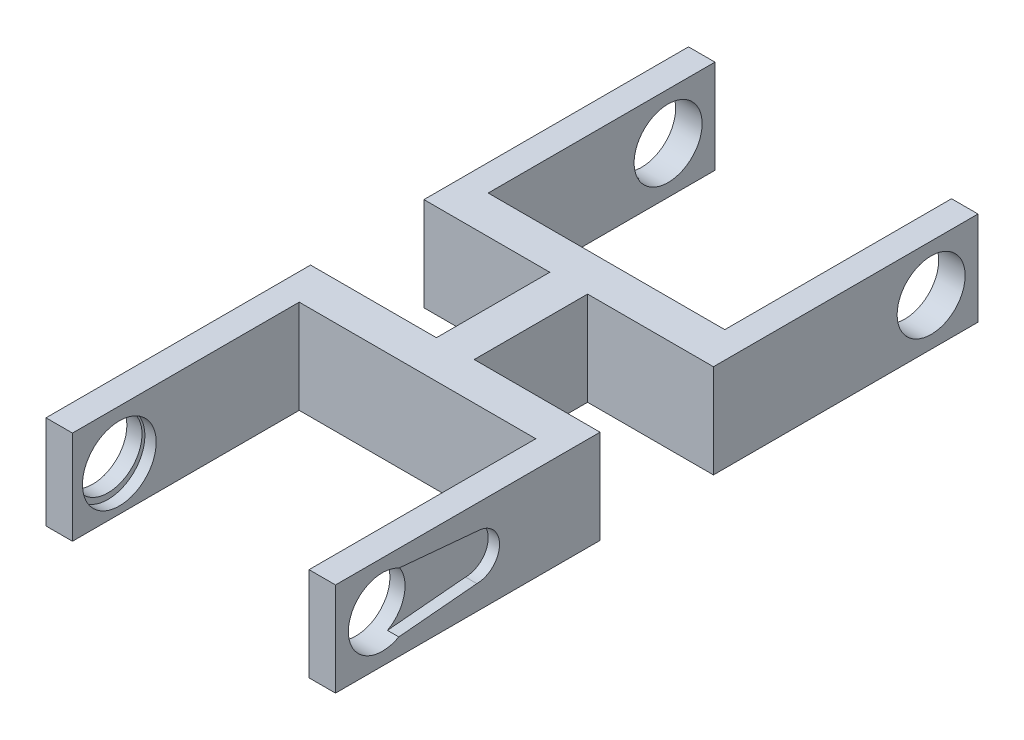
ISO-10303-21;
HEADER;
FILE_DESCRIPTION(('STEP AP214'),'2;1');
FILE_NAME('part.step','',(''),(''),'','','');
FILE_SCHEMA(('AUTOMOTIVE_DESIGN { 1 0 10303 214 1 1 1 1 }'));
ENDSEC;
DATA;
#1=APPLICATION_CONTEXT('core data for automotive mechanical design processes');
#2=APPLICATION_PROTOCOL_DEFINITION('international standard','automotive_design',2000,#1);
#3=PRODUCT_CONTEXT('',#1,'mechanical');
#4=PRODUCT('Part','Part','',(#3));
#5=PRODUCT_RELATED_PRODUCT_CATEGORY('part','',(#4));
#6=PRODUCT_DEFINITION_FORMATION('','',#4);
#7=PRODUCT_DEFINITION_CONTEXT('part definition',#1,'design');
#8=PRODUCT_DEFINITION('design','',#6,#7);
#9=PRODUCT_DEFINITION_SHAPE('','',#8);
#10=(LENGTH_UNIT() NAMED_UNIT(*) SI_UNIT(.MILLI.,.METRE.));
#11=(NAMED_UNIT(*) PLANE_ANGLE_UNIT() SI_UNIT($,.RADIAN.));
#12=(NAMED_UNIT(*) SI_UNIT($,.STERADIAN.) SOLID_ANGLE_UNIT());
#13=UNCERTAINTY_MEASURE_WITH_UNIT(LENGTH_MEASURE(1.E-05),#10,'distance_accuracy_value','');
#14=(GEOMETRIC_REPRESENTATION_CONTEXT(3) GLOBAL_UNCERTAINTY_ASSIGNED_CONTEXT((#13)) GLOBAL_UNIT_ASSIGNED_CONTEXT((#10,
#11,#12)) REPRESENTATION_CONTEXT('',''));
#15=CARTESIAN_POINT('',(0.,0.,0.));
#16=DIRECTION('',(0.,0.,1.));
#17=DIRECTION('',(1.,0.,0.));
#18=AXIS2_PLACEMENT_3D('',#15,#16,#17);
#19=CARTESIAN_POINT('',(0.,0.,-20.));
#20=DIRECTION('',(0.,0.,1.));
#21=DIRECTION('',(1.,0.,0.));
#22=AXIS2_PLACEMENT_3D('',#19,#20,#21);
#23=PLANE('',#22);
#24=DIRECTION('',(0.,-1.,0.));
#25=VECTOR('',#24,1.);
#26=CARTESIAN_POINT('',(-15.65,-6.2,-20.));
#27=LINE('',#26,#25);
#28=CARTESIAN_POINT('',(-15.65,6.2,-20.));
#29=VERTEX_POINT('',#28);
#30=CARTESIAN_POINT('',(-15.65,-6.2,-20.));
#31=VERTEX_POINT('',#30);
#32=EDGE_CURVE('E268',#29,#31,#27,.T.);
#33=ORIENTED_EDGE('',*,*,#32,.F.);
#34=DIRECTION('',(1.,0.,0.));
#35=VECTOR('',#34,1.);
#36=CARTESIAN_POINT('',(22.15,6.2,-20.));
#37=LINE('',#36,#35);
#38=CARTESIAN_POINT('',(15.65,6.2,-20.));
#39=VERTEX_POINT('',#38);
#40=EDGE_CURVE('E285',#29,#39,#37,.T.);
#41=ORIENTED_EDGE('',*,*,#40,.T.);
#42=DIRECTION('',(0.,1.,0.));
#43=VECTOR('',#42,1.);
#44=CARTESIAN_POINT('',(15.65,0.,-20.));
#45=LINE('',#44,#43);
#46=CARTESIAN_POINT('',(15.65,-6.2,-20.));
#47=VERTEX_POINT('',#46);
#48=EDGE_CURVE('E282',#47,#39,#45,.T.);
#49=ORIENTED_EDGE('',*,*,#48,.F.);
#50=DIRECTION('',(-1.,0.,0.));
#51=VECTOR('',#50,1.);
#52=CARTESIAN_POINT('',(22.15,-6.2,-20.));
#53=LINE('',#52,#51);
#54=EDGE_CURVE('E259',#47,#31,#53,.T.);
#55=ORIENTED_EDGE('',*,*,#54,.T.);
#56=EDGE_LOOP('',(#33,#41,#49,#55));
#57=FACE_BOUND('',#56,.T.);
#58=ADVANCED_FACE('F65',(#57),#23,.F.);
#59=CARTESIAN_POINT('',(-17.15,6.2,35.));
#60=DIRECTION('',(-1.,0.,0.));
#61=DIRECTION('',(0.,0.,1.));
#62=AXIS2_PLACEMENT_3D('',#59,#60,#61);
#63=PLANE('',#62);
#64=CARTESIAN_POINT('',(-17.15,0.,28.8));
#65=DIRECTION('',(-1.,0.,0.));
#66=DIRECTION('',(0.,0.,1.));
#67=AXIS2_PLACEMENT_3D('',#64,#65,#66);
#68=CIRCLE('',#67,4.5);
#69=CARTESIAN_POINT('',(-17.15,4.5,28.8));
#70=VERTEX_POINT('',#69);
#71=EDGE_CURVE('E284',#70,#70,#68,.T.);
#72=ORIENTED_EDGE('',*,*,#71,.T.);
#73=CARTESIAN_POINT('',(-17.15,-0.377092339537284,28.8));
#74=DIRECTION('',(1.,0.,0.));
#75=DIRECTION('',(0.,0.,-1.));
#76=AXIS2_PLACEMENT_3D('',#73,#74,#75);
#77=CIRCLE('',#76,4.87709233953728);
#78=EDGE_CURVE('E79',#70,#70,#77,.T.);
#79=ORIENTED_EDGE('',*,*,#78,.T.);
#80=EDGE_LOOP('',(#72,#79));
#81=FACE_BOUND('',#80,.T.);
#82=ADVANCED_FACE('F555',(#81),#63,.F.);
#83=CARTESIAN_POINT('',(0.,0.,0.));
#84=DIRECTION('',(0.,0.,1.));
#85=DIRECTION('',(1.,0.,0.));
#86=AXIS2_PLACEMENT_3D('',#83,#84,#85);
#87=PLANE('',#86);
#88=DIRECTION('',(1.,0.,0.));
#89=VECTOR('',#88,1.);
#90=CARTESIAN_POINT('',(-22.15,-6.2,0.));
#91=LINE('',#90,#89);
#92=CARTESIAN_POINT('',(-19.15,-6.2,0.));
#93=VERTEX_POINT('',#92);
#94=CARTESIAN_POINT('',(-2.5,-6.2,0.));
#95=VERTEX_POINT('',#94);
#96=EDGE_CURVE('E322',#93,#95,#91,.T.);
#97=ORIENTED_EDGE('',*,*,#96,.F.);
#98=DIRECTION('',(0.,1.,0.));
#99=VECTOR('',#98,1.);
#100=CARTESIAN_POINT('',(-19.15,0.,0.));
#101=LINE('',#100,#99);
#102=CARTESIAN_POINT('',(-19.15,6.2,0.));
#103=VERTEX_POINT('',#102);
#104=EDGE_CURVE('E515',#93,#103,#101,.T.);
#105=ORIENTED_EDGE('',*,*,#104,.T.);
#106=DIRECTION('',(-1.,0.,0.));
#107=VECTOR('',#106,1.);
#108=CARTESIAN_POINT('',(-22.15,6.2,0.));
#109=LINE('',#108,#107);
#110=CARTESIAN_POINT('',(-2.5,6.2,0.));
#111=VERTEX_POINT('',#110);
#112=EDGE_CURVE('E316',#111,#103,#109,.T.);
#113=ORIENTED_EDGE('',*,*,#112,.F.);
#114=DIRECTION('',(0.,1.,0.));
#115=VECTOR('',#114,1.);
#116=CARTESIAN_POINT('',(-2.5,-6.2,0.));
#117=LINE('',#116,#115);
#118=EDGE_CURVE('E403',#95,#111,#117,.T.);
#119=ORIENTED_EDGE('',*,*,#118,.F.);
#120=EDGE_LOOP('',(#97,#105,#113,#119));
#121=FACE_BOUND('',#120,.T.);
#122=ADVANCED_FACE('F560',(#121),#87,.F.);
#123=CARTESIAN_POINT('',(19.15,6.2,0.));
#124=VERTEX_POINT('',#123);
#125=CARTESIAN_POINT('',(2.49999999999999,6.2,0.));
#126=VERTEX_POINT('',#125);
#127=EDGE_CURVE('E325',#124,#126,#109,.T.);
#128=ORIENTED_EDGE('',*,*,#127,.F.);
#129=DIRECTION('',(0.,-1.,0.));
#130=VECTOR('',#129,1.);
#131=CARTESIAN_POINT('',(19.15,0.,0.));
#132=LINE('',#131,#130);
#133=CARTESIAN_POINT('',(19.15,-6.2,0.));
#134=VERTEX_POINT('',#133);
#135=EDGE_CURVE('E492',#124,#134,#132,.T.);
#136=ORIENTED_EDGE('',*,*,#135,.T.);
#137=CARTESIAN_POINT('',(2.49999999999999,-6.2,0.));
#138=VERTEX_POINT('',#137);
#139=EDGE_CURVE('E328',#138,#134,#91,.T.);
#140=ORIENTED_EDGE('',*,*,#139,.F.);
#141=DIRECTION('',(0.,1.,0.));
#142=VECTOR('',#141,1.);
#143=CARTESIAN_POINT('',(2.49999999999999,-6.2,0.));
#144=LINE('',#143,#142);
#145=EDGE_CURVE('E415',#138,#126,#144,.T.);
#146=ORIENTED_EDGE('',*,*,#145,.T.);
#147=EDGE_LOOP('',(#128,#136,#140,#146));
#148=FACE_BOUND('',#147,.T.);
#149=ADVANCED_FACE('F585',(#148),#87,.F.);
#150=CARTESIAN_POINT('',(0.,0.,5.));
#151=DIRECTION('',(0.,0.,1.));
#152=DIRECTION('',(1.,0.,0.));
#153=AXIS2_PLACEMENT_3D('',#150,#151,#152);
#154=PLANE('',#153);
#155=DIRECTION('',(0.,1.,0.));
#156=VECTOR('',#155,1.);
#157=CARTESIAN_POINT('',(-15.65,-6.2,5.));
#158=LINE('',#157,#156);
#159=CARTESIAN_POINT('',(-15.65,-6.2,5.));
#160=VERTEX_POINT('',#159);
#161=CARTESIAN_POINT('',(-15.65,6.2,5.));
#162=VERTEX_POINT('',#161);
#163=EDGE_CURVE('E909',#160,#162,#158,.T.);
#164=ORIENTED_EDGE('',*,*,#163,.F.);
#165=DIRECTION('',(1.,0.,0.));
#166=VECTOR('',#165,1.);
#167=CARTESIAN_POINT('',(-22.15,-6.2,5.));
#168=LINE('',#167,#166);
#169=CARTESIAN_POINT('',(15.65,-6.2,5.));
#170=VERTEX_POINT('',#169);
#171=EDGE_CURVE('E321',#160,#170,#168,.T.);
#172=ORIENTED_EDGE('',*,*,#171,.T.);
#173=DIRECTION('',(0.,-1.,0.));
#174=VECTOR('',#173,1.);
#175=CARTESIAN_POINT('',(15.65,0.,5.));
#176=LINE('',#175,#174);
#177=CARTESIAN_POINT('',(15.65,6.2,5.));
#178=VERTEX_POINT('',#177);
#179=EDGE_CURVE('E942',#178,#170,#176,.T.);
#180=ORIENTED_EDGE('',*,*,#179,.F.);
#181=DIRECTION('',(-1.,0.,0.));
#182=VECTOR('',#181,1.);
#183=CARTESIAN_POINT('',(-22.15,6.2,5.));
#184=LINE('',#183,#182);
#185=EDGE_CURVE('E317',#178,#162,#184,.T.);
#186=ORIENTED_EDGE('',*,*,#185,.T.);
#187=EDGE_LOOP('',(#164,#172,#180,#186));
#188=FACE_BOUND('',#187,.T.);
#189=ADVANCED_FACE('F582',(#188),#154,.T.);
#190=CARTESIAN_POINT('',(-22.15,6.2,5.));
#191=DIRECTION('',(0.,-1.,0.));
#192=DIRECTION('',(0.,0.,-1.));
#193=AXIS2_PLACEMENT_3D('',#190,#191,#192);
#194=PLANE('',#193);
#195=ORIENTED_EDGE('',*,*,#40,.F.);
#196=DIRECTION('',(0.,0.,1.));
#197=VECTOR('',#196,1.);
#198=CARTESIAN_POINT('',(-15.65,6.2,-20.));
#199=LINE('',#198,#197);
#200=CARTESIAN_POINT('',(-15.65,6.2,-50.));
#201=VERTEX_POINT('',#200);
#202=EDGE_CURVE('E274',#201,#29,#199,.T.);
#203=ORIENTED_EDGE('',*,*,#202,.F.);
#204=DIRECTION('',(1.,0.,0.));
#205=VECTOR('',#204,1.);
#206=CARTESIAN_POINT('',(-22.15,6.2,-50.));
#207=LINE('',#206,#205);
#208=CARTESIAN_POINT('',(-19.15,6.2,-50.));
#209=VERTEX_POINT('',#208);
#210=EDGE_CURVE('E407',#209,#201,#207,.T.);
#211=ORIENTED_EDGE('',*,*,#210,.F.);
#212=DIRECTION('',(0.,0.,-1.));
#213=VECTOR('',#212,1.);
#214=CARTESIAN_POINT('',(-19.15,6.2,-50.));
#215=LINE('',#214,#213);
#216=CARTESIAN_POINT('',(-19.15,6.2,-15.));
#217=VERTEX_POINT('',#216);
#218=EDGE_CURVE('E474',#217,#209,#215,.T.);
#219=ORIENTED_EDGE('',*,*,#218,.F.);
#220=DIRECTION('',(1.,0.,0.));
#221=VECTOR('',#220,1.);
#222=CARTESIAN_POINT('',(22.15,6.2,-15.));
#223=LINE('',#222,#221);
#224=CARTESIAN_POINT('',(-2.5,6.2,-15.));
#225=VERTEX_POINT('',#224);
#226=EDGE_CURVE('E296',#217,#225,#223,.T.);
#227=ORIENTED_EDGE('',*,*,#226,.T.);
#228=DIRECTION('',(0.,0.,-1.));
#229=VECTOR('',#228,1.);
#230=CARTESIAN_POINT('',(-2.5,6.2,-15.));
#231=LINE('',#230,#229);
#232=EDGE_CURVE('E398',#111,#225,#231,.T.);
#233=ORIENTED_EDGE('',*,*,#232,.F.);
#234=ORIENTED_EDGE('',*,*,#112,.T.);
#235=CARTESIAN_POINT('',(-19.15,6.2,35.));
#236=VERTEX_POINT('',#235);
#237=EDGE_CURVE('E970',#236,#103,#215,.T.);
#238=ORIENTED_EDGE('',*,*,#237,.F.);
#239=DIRECTION('',(-1.,0.,0.));
#240=VECTOR('',#239,1.);
#241=CARTESIAN_POINT('',(-22.15,6.2,35.));
#242=LINE('',#241,#240);
#243=CARTESIAN_POINT('',(-15.65,6.2,35.));
#244=VERTEX_POINT('',#243);
#245=EDGE_CURVE('E305',#244,#236,#242,.T.);
#246=ORIENTED_EDGE('',*,*,#245,.F.);
#247=DIRECTION('',(0.,0.,1.));
#248=VECTOR('',#247,1.);
#249=CARTESIAN_POINT('',(-15.65,6.2,5.));
#250=LINE('',#249,#248);
#251=EDGE_CURVE('E914',#162,#244,#250,.T.);
#252=ORIENTED_EDGE('',*,*,#251,.F.);
#253=ORIENTED_EDGE('',*,*,#185,.F.);
#254=DIRECTION('',(0.,0.,-1.));
#255=VECTOR('',#254,1.);
#256=CARTESIAN_POINT('',(15.65,6.2,0.));
#257=LINE('',#256,#255);
#258=CARTESIAN_POINT('',(15.65,6.2,35.));
#259=VERTEX_POINT('',#258);
#260=EDGE_CURVE('E946',#259,#178,#257,.T.);
#261=ORIENTED_EDGE('',*,*,#260,.F.);
#262=DIRECTION('',(-1.,0.,0.));
#263=VECTOR('',#262,1.);
#264=CARTESIAN_POINT('',(22.15,6.2,35.));
#265=LINE('',#264,#263);
#266=CARTESIAN_POINT('',(19.15,6.2,35.));
#267=VERTEX_POINT('',#266);
#268=EDGE_CURVE('E309',#267,#259,#265,.T.);
#269=ORIENTED_EDGE('',*,*,#268,.F.);
#270=DIRECTION('',(0.,0.,1.));
#271=VECTOR('',#270,1.);
#272=CARTESIAN_POINT('',(19.15,6.2,-50.));
#273=LINE('',#272,#271);
#274=EDGE_CURVE('E86',#124,#267,#273,.T.);
#275=ORIENTED_EDGE('',*,*,#274,.F.);
#276=ORIENTED_EDGE('',*,*,#127,.T.);
#277=DIRECTION('',(0.,0.,1.));
#278=VECTOR('',#277,1.);
#279=CARTESIAN_POINT('',(2.49999999999999,6.2,-15.));
#280=LINE('',#279,#278);
#281=CARTESIAN_POINT('',(2.49999999999999,6.2,-15.));
#282=VERTEX_POINT('',#281);
#283=EDGE_CURVE('E381',#282,#126,#280,.T.);
#284=ORIENTED_EDGE('',*,*,#283,.F.);
#285=CARTESIAN_POINT('',(19.15,6.2,-15.));
#286=VERTEX_POINT('',#285);
#287=EDGE_CURVE('E300',#282,#286,#223,.T.);
#288=ORIENTED_EDGE('',*,*,#287,.T.);
#289=CARTESIAN_POINT('',(19.15,6.2,-50.));
#290=VERTEX_POINT('',#289);
#291=EDGE_CURVE('E442',#290,#286,#273,.T.);
#292=ORIENTED_EDGE('',*,*,#291,.F.);
#293=DIRECTION('',(1.,0.,0.));
#294=VECTOR('',#293,1.);
#295=CARTESIAN_POINT('',(22.15,6.2,-50.));
#296=LINE('',#295,#294);
#297=CARTESIAN_POINT('',(15.65,6.2,-50.));
#298=VERTEX_POINT('',#297);
#299=EDGE_CURVE('E431',#298,#290,#296,.T.);
#300=ORIENTED_EDGE('',*,*,#299,.F.);
#301=DIRECTION('',(0.,0.,-1.));
#302=VECTOR('',#301,1.);
#303=CARTESIAN_POINT('',(15.65,6.2,0.));
#304=LINE('',#303,#302);
#305=EDGE_CURVE('E961',#39,#298,#304,.T.);
#306=ORIENTED_EDGE('',*,*,#305,.F.);
#307=EDGE_LOOP('',(#195,#203,#211,#219,#227,#233,#234,#238,#246,#252,#253,#261,#269,#275,#276,
#284,#288,#292,#300,#306));
#308=FACE_BOUND('',#307,.T.);
#309=ADVANCED_FACE('F67',(#308),#194,.F.);
#310=CARTESIAN_POINT('',(-22.15,-6.2,5.));
#311=DIRECTION('',(0.,1.,0.));
#312=DIRECTION('',(0.,0.,1.));
#313=AXIS2_PLACEMENT_3D('',#310,#311,#312);
#314=PLANE('',#313);
#315=ORIENTED_EDGE('',*,*,#171,.F.);
#316=DIRECTION('',(0.,0.,-1.));
#317=VECTOR('',#316,1.);
#318=CARTESIAN_POINT('',(-15.65,-6.2,5.));
#319=LINE('',#318,#317);
#320=CARTESIAN_POINT('',(-15.65,-6.2,35.));
#321=VERTEX_POINT('',#320);
#322=EDGE_CURVE('E927',#321,#160,#319,.T.);
#323=ORIENTED_EDGE('',*,*,#322,.F.);
#324=DIRECTION('',(1.,0.,0.));
#325=VECTOR('',#324,1.);
#326=CARTESIAN_POINT('',(-22.15,-6.2,35.));
#327=LINE('',#326,#325);
#328=CARTESIAN_POINT('',(-19.15,-6.2,35.));
#329=VERTEX_POINT('',#328);
#330=EDGE_CURVE('E290',#329,#321,#327,.T.);
#331=ORIENTED_EDGE('',*,*,#330,.F.);
#332=DIRECTION('',(0.,0.,-1.));
#333=VECTOR('',#332,1.);
#334=CARTESIAN_POINT('',(-19.15,-6.2,-50.));
#335=LINE('',#334,#333);
#336=EDGE_CURVE('E965',#329,#93,#335,.T.);
#337=ORIENTED_EDGE('',*,*,#336,.T.);
#338=ORIENTED_EDGE('',*,*,#96,.T.);
#339=DIRECTION('',(0.,0.,-1.));
#340=VECTOR('',#339,1.);
#341=CARTESIAN_POINT('',(-2.5,-6.2,-15.));
#342=LINE('',#341,#340);
#343=CARTESIAN_POINT('',(-2.5,-6.2,-15.));
#344=VERTEX_POINT('',#343);
#345=EDGE_CURVE('E393',#95,#344,#342,.T.);
#346=ORIENTED_EDGE('',*,*,#345,.T.);
#347=DIRECTION('',(-1.,0.,0.));
#348=VECTOR('',#347,1.);
#349=CARTESIAN_POINT('',(22.15,-6.2,-15.));
#350=LINE('',#349,#348);
#351=CARTESIAN_POINT('',(-19.15,-6.2,-15.));
#352=VERTEX_POINT('',#351);
#353=EDGE_CURVE('E299',#344,#352,#350,.T.);
#354=ORIENTED_EDGE('',*,*,#353,.T.);
#355=CARTESIAN_POINT('',(-19.15,-6.2,-50.));
#356=VERTEX_POINT('',#355);
#357=EDGE_CURVE('E969',#352,#356,#335,.T.);
#358=ORIENTED_EDGE('',*,*,#357,.T.);
#359=DIRECTION('',(-1.,0.,0.));
#360=VECTOR('',#359,1.);
#361=CARTESIAN_POINT('',(-22.15,-6.2,-50.));
#362=LINE('',#361,#360);
#363=CARTESIAN_POINT('',(-15.65,-6.2,-50.));
#364=VERTEX_POINT('',#363);
#365=EDGE_CURVE('E262',#364,#356,#362,.T.);
#366=ORIENTED_EDGE('',*,*,#365,.F.);
#367=DIRECTION('',(0.,0.,-1.));
#368=VECTOR('',#367,1.);
#369=CARTESIAN_POINT('',(-15.65,-6.2,-20.));
#370=LINE('',#369,#368);
#371=EDGE_CURVE('E253',#31,#364,#370,.T.);
#372=ORIENTED_EDGE('',*,*,#371,.F.);
#373=ORIENTED_EDGE('',*,*,#54,.F.);
#374=DIRECTION('',(0.,0.,-1.));
#375=VECTOR('',#374,1.);
#376=CARTESIAN_POINT('',(15.65,-6.2,0.));
#377=LINE('',#376,#375);
#378=CARTESIAN_POINT('',(15.65,-6.2,-50.));
#379=VERTEX_POINT('',#378);
#380=EDGE_CURVE('E956',#47,#379,#377,.T.);
#381=ORIENTED_EDGE('',*,*,#380,.T.);
#382=DIRECTION('',(-1.,0.,0.));
#383=VECTOR('',#382,1.);
#384=CARTESIAN_POINT('',(22.15,-6.2,-50.));
#385=LINE('',#384,#383);
#386=CARTESIAN_POINT('',(19.15,-6.2,-50.));
#387=VERTEX_POINT('',#386);
#388=EDGE_CURVE('E429',#387,#379,#385,.T.);
#389=ORIENTED_EDGE('',*,*,#388,.F.);
#390=DIRECTION('',(0.,0.,1.));
#391=VECTOR('',#390,1.);
#392=CARTESIAN_POINT('',(19.15,-6.2,-50.));
#393=LINE('',#392,#391);
#394=CARTESIAN_POINT('',(19.15,-6.2,-15.));
#395=VERTEX_POINT('',#394);
#396=EDGE_CURVE('E457',#387,#395,#393,.T.);
#397=ORIENTED_EDGE('',*,*,#396,.T.);
#398=CARTESIAN_POINT('',(2.49999999999999,-6.2,-15.));
#399=VERTEX_POINT('',#398);
#400=EDGE_CURVE('E292',#395,#399,#350,.T.);
#401=ORIENTED_EDGE('',*,*,#400,.T.);
#402=DIRECTION('',(0.,0.,1.));
#403=VECTOR('',#402,1.);
#404=CARTESIAN_POINT('',(2.49999999999999,-6.2,-15.));
#405=LINE('',#404,#403);
#406=EDGE_CURVE('E411',#399,#138,#405,.T.);
#407=ORIENTED_EDGE('',*,*,#406,.T.);
#408=ORIENTED_EDGE('',*,*,#139,.T.);
#409=CARTESIAN_POINT('',(19.15,-6.2,35.));
#410=VERTEX_POINT('',#409);
#411=EDGE_CURVE('E461',#134,#410,#393,.T.);
#412=ORIENTED_EDGE('',*,*,#411,.T.);
#413=DIRECTION('',(1.,0.,0.));
#414=VECTOR('',#413,1.);
#415=CARTESIAN_POINT('',(22.15,-6.2,35.));
#416=LINE('',#415,#414);
#417=CARTESIAN_POINT('',(15.65,-6.2,35.));
#418=VERTEX_POINT('',#417);
#419=EDGE_CURVE('E312',#418,#410,#416,.T.);
#420=ORIENTED_EDGE('',*,*,#419,.F.);
#421=DIRECTION('',(0.,0.,1.));
#422=VECTOR('',#421,1.);
#423=CARTESIAN_POINT('',(15.65,-6.2,0.));
#424=LINE('',#423,#422);
#425=EDGE_CURVE('E938',#170,#418,#424,.T.);
#426=ORIENTED_EDGE('',*,*,#425,.F.);
#427=EDGE_LOOP('',(#315,#323,#331,#337,#338,#346,#354,#358,#366,#372,#373,#381,#389,#397,#401,
#407,#408,#412,#420,#426));
#428=FACE_BOUND('',#427,.T.);
#429=ADVANCED_FACE('F256',(#428),#314,.F.);
#430=CARTESIAN_POINT('',(0.,0.,35.));
#431=DIRECTION('',(0.,0.,-1.));
#432=DIRECTION('',(-1.,0.,0.));
#433=AXIS2_PLACEMENT_3D('',#430,#431,#432);
#434=PLANE('',#433);
#435=ORIENTED_EDGE('',*,*,#419,.T.);
#436=DIRECTION('',(0.,1.,0.));
#437=VECTOR('',#436,1.);
#438=CARTESIAN_POINT('',(19.15,-6.2,35.));
#439=LINE('',#438,#437);
#440=EDGE_CURVE('E465',#410,#267,#439,.T.);
#441=ORIENTED_EDGE('',*,*,#440,.T.);
#442=ORIENTED_EDGE('',*,*,#268,.T.);
#443=DIRECTION('',(0.,1.,0.));
#444=VECTOR('',#443,1.);
#445=CARTESIAN_POINT('',(15.65,0.,35.));
#446=LINE('',#445,#444);
#447=EDGE_CURVE('E934',#418,#259,#446,.T.);
#448=ORIENTED_EDGE('',*,*,#447,.F.);
#449=EDGE_LOOP('',(#435,#441,#442,#448));
#450=FACE_BOUND('',#449,.T.);
#451=ADVANCED_FACE('F576',(#450),#434,.F.);
#452=CARTESIAN_POINT('',(0.,0.,35.));
#453=DIRECTION('',(0.,0.,1.));
#454=DIRECTION('',(1.,0.,0.));
#455=AXIS2_PLACEMENT_3D('',#452,#453,#454);
#456=PLANE('',#455);
#457=DIRECTION('',(0.,1.,0.));
#458=VECTOR('',#457,1.);
#459=CARTESIAN_POINT('',(-19.15,-6.2,35.));
#460=LINE('',#459,#458);
#461=EDGE_CURVE('E469',#329,#236,#460,.T.);
#462=ORIENTED_EDGE('',*,*,#461,.F.);
#463=ORIENTED_EDGE('',*,*,#330,.T.);
#464=DIRECTION('',(0.,-1.,0.));
#465=VECTOR('',#464,1.);
#466=CARTESIAN_POINT('',(-15.65,-6.2,35.));
#467=LINE('',#466,#465);
#468=EDGE_CURVE('E923',#244,#321,#467,.T.);
#469=ORIENTED_EDGE('',*,*,#468,.F.);
#470=ORIENTED_EDGE('',*,*,#245,.T.);
#471=EDGE_LOOP('',(#462,#463,#469,#470));
#472=FACE_BOUND('',#471,.T.);
#473=ADVANCED_FACE('F573',(#472),#456,.T.);
#474=CARTESIAN_POINT('',(-27.85,0.,28.8));
#475=DIRECTION('',(1.,0.,0.));
#476=DIRECTION('',(0.,0.,-1.));
#477=AXIS2_PLACEMENT_3D('',#474,#475,#476);
#478=CYLINDRICAL_SURFACE('',#477,4.5);
#479=CARTESIAN_POINT('',(-19.15,0.,28.8));
#480=DIRECTION('',(1.,0.,0.));
#481=DIRECTION('',(0.,0.,-1.));
#482=AXIS2_PLACEMENT_3D('',#479,#480,#481);
#483=CIRCLE('',#482,4.5);
#484=CARTESIAN_POINT('',(-19.15,0.,24.3));
#485=VERTEX_POINT('',#484);
#486=EDGE_CURVE('E511',#485,#485,#483,.F.);
#487=ORIENTED_EDGE('',*,*,#486,.T.);
#488=EDGE_LOOP('',(#487));
#489=FACE_BOUND('',#488,.T.);
#490=ORIENTED_EDGE('',*,*,#71,.F.);
#491=EDGE_LOOP('',(#490));
#492=FACE_BOUND('',#491,.T.);
#493=ADVANCED_FACE('F570',(#489,#492),#478,.F.);
#494=DIRECTION('',(1.,0.,0.));
#495=VECTOR('',#494,1.);
#496=CARTESIAN_POINT('',(17.65,3.94071478051588,26.6272673844617));
#497=LINE('',#496,#495);
#498=CARTESIAN_POINT('',(17.65,3.94071478051588,26.6272673844617));
#499=VERTEX_POINT('',#498);
#500=CARTESIAN_POINT('',(19.15,3.94071478051588,26.6272673844617));
#501=VERTEX_POINT('',#500);
#502=EDGE_CURVE('E338',#499,#501,#497,.T.);
#503=ORIENTED_EDGE('',*,*,#502,.T.);
#504=CARTESIAN_POINT('',(19.15,0.,28.8));
#505=DIRECTION('',(-1.,0.,0.));
#506=DIRECTION('',(0.,0.,1.));
#507=AXIS2_PLACEMENT_3D('',#504,#505,#506);
#508=CIRCLE('',#507,4.5);
#509=CARTESIAN_POINT('',(19.15,-3.94071478051588,26.6272673844617));
#510=VERTEX_POINT('',#509);
#511=EDGE_CURVE('E348',#501,#510,#508,.F.);
#512=ORIENTED_EDGE('',*,*,#511,.T.);
#513=DIRECTION('',(1.,0.,0.));
#514=VECTOR('',#513,1.);
#515=CARTESIAN_POINT('',(17.65,-3.94071478051588,26.6272673844617));
#516=LINE('',#515,#514);
#517=CARTESIAN_POINT('',(17.65,-3.94071478051588,26.6272673844617));
#518=VERTEX_POINT('',#517);
#519=EDGE_CURVE('E352',#518,#510,#516,.T.);
#520=ORIENTED_EDGE('',*,*,#519,.F.);
#521=CARTESIAN_POINT('',(17.65,0.,28.8));
#522=DIRECTION('',(-1.,0.,0.));
#523=DIRECTION('',(0.,0.,1.));
#524=AXIS2_PLACEMENT_3D('',#521,#522,#523);
#525=CIRCLE('',#524,4.5);
#526=EDGE_CURVE('E350',#499,#518,#525,.T.);
#527=ORIENTED_EDGE('',*,*,#526,.F.);
#528=EDGE_LOOP('',(#503,#512,#520,#527));
#529=FACE_BOUND('',#528,.T.);
#530=CARTESIAN_POINT('',(15.65,0.,28.8));
#531=DIRECTION('',(1.,0.,0.));
#532=DIRECTION('',(0.,0.,-1.));
#533=AXIS2_PLACEMENT_3D('',#530,#531,#532);
#534=CIRCLE('',#533,4.5);
#535=CARTESIAN_POINT('',(15.65,0.,24.3));
#536=VERTEX_POINT('',#535);
#537=EDGE_CURVE('E930',#536,#536,#534,.T.);
#538=ORIENTED_EDGE('',*,*,#537,.F.);
#539=EDGE_LOOP('',(#538));
#540=FACE_BOUND('',#539,.T.);
#541=ADVANCED_FACE('F345',(#529,#540),#478,.F.);
#542=CARTESIAN_POINT('',(0.,0.,-15.));
#543=DIRECTION('',(0.,0.,1.));
#544=DIRECTION('',(1.,0.,0.));
#545=AXIS2_PLACEMENT_3D('',#542,#543,#544);
#546=PLANE('',#545);
#547=DIRECTION('',(0.,1.,0.));
#548=VECTOR('',#547,1.);
#549=CARTESIAN_POINT('',(-19.15,0.,-15.));
#550=LINE('',#549,#548);
#551=EDGE_CURVE('E508',#352,#217,#550,.T.);
#552=ORIENTED_EDGE('',*,*,#551,.F.);
#553=ORIENTED_EDGE('',*,*,#353,.F.);
#554=DIRECTION('',(0.,1.,0.));
#555=VECTOR('',#554,1.);
#556=CARTESIAN_POINT('',(-2.5,-6.2,-15.));
#557=LINE('',#556,#555);
#558=EDGE_CURVE('E397',#344,#225,#557,.T.);
#559=ORIENTED_EDGE('',*,*,#558,.T.);
#560=ORIENTED_EDGE('',*,*,#226,.F.);
#561=EDGE_LOOP('',(#552,#553,#559,#560));
#562=FACE_BOUND('',#561,.T.);
#563=ADVANCED_FACE('F569',(#562),#546,.T.);
#564=DIRECTION('',(0.,-1.,0.));
#565=VECTOR('',#564,1.);
#566=CARTESIAN_POINT('',(19.15,0.,-15.));
#567=LINE('',#566,#565);
#568=EDGE_CURVE('E449',#286,#395,#567,.T.);
#569=ORIENTED_EDGE('',*,*,#568,.F.);
#570=ORIENTED_EDGE('',*,*,#287,.F.);
#571=DIRECTION('',(0.,1.,0.));
#572=VECTOR('',#571,1.);
#573=CARTESIAN_POINT('',(2.49999999999999,-6.2,-15.));
#574=LINE('',#573,#572);
#575=EDGE_CURVE('E402',#399,#282,#574,.T.);
#576=ORIENTED_EDGE('',*,*,#575,.F.);
#577=ORIENTED_EDGE('',*,*,#400,.F.);
#578=EDGE_LOOP('',(#569,#570,#576,#577));
#579=FACE_BOUND('',#578,.T.);
#580=ADVANCED_FACE('F446',(#579),#546,.T.);
#581=CARTESIAN_POINT('',(0.,0.,-50.));
#582=DIRECTION('',(0.,0.,-1.));
#583=DIRECTION('',(-1.,0.,0.));
#584=AXIS2_PLACEMENT_3D('',#581,#582,#583);
#585=PLANE('',#584);
#586=DIRECTION('',(0.,1.,0.));
#587=VECTOR('',#586,1.);
#588=CARTESIAN_POINT('',(19.15,-6.2,-50.));
#589=LINE('',#588,#587);
#590=EDGE_CURVE('E460',#387,#290,#589,.T.);
#591=ORIENTED_EDGE('',*,*,#590,.F.);
#592=ORIENTED_EDGE('',*,*,#388,.T.);
#593=DIRECTION('',(0.,1.,0.));
#594=VECTOR('',#593,1.);
#595=CARTESIAN_POINT('',(15.65,0.,-50.));
#596=LINE('',#595,#594);
#597=EDGE_CURVE('E953',#379,#298,#596,.T.);
#598=ORIENTED_EDGE('',*,*,#597,.T.);
#599=ORIENTED_EDGE('',*,*,#299,.T.);
#600=EDGE_LOOP('',(#591,#592,#598,#599));
#601=FACE_BOUND('',#600,.T.);
#602=ADVANCED_FACE('F565',(#601),#585,.T.);
#603=CARTESIAN_POINT('',(0.,0.,-50.));
#604=DIRECTION('',(0.,0.,1.));
#605=DIRECTION('',(1.,0.,0.));
#606=AXIS2_PLACEMENT_3D('',#603,#604,#605);
#607=PLANE('',#606);
#608=ORIENTED_EDGE('',*,*,#365,.T.);
#609=DIRECTION('',(0.,1.,0.));
#610=VECTOR('',#609,1.);
#611=CARTESIAN_POINT('',(-19.15,-6.2,-50.));
#612=LINE('',#611,#610);
#613=EDGE_CURVE('E479',#356,#209,#612,.T.);
#614=ORIENTED_EDGE('',*,*,#613,.T.);
#615=ORIENTED_EDGE('',*,*,#210,.T.);
#616=DIRECTION('',(0.,1.,0.));
#617=VECTOR('',#616,1.);
#618=CARTESIAN_POINT('',(-15.65,-6.2,-50.));
#619=LINE('',#618,#617);
#620=EDGE_CURVE('E267',#364,#201,#619,.T.);
#621=ORIENTED_EDGE('',*,*,#620,.F.);
#622=EDGE_LOOP('',(#608,#614,#615,#621));
#623=FACE_BOUND('',#622,.T.);
#624=ADVANCED_FACE('F676',(#623),#607,.F.);
#625=CARTESIAN_POINT('',(27.85,0.,-43.8));
#626=DIRECTION('',(-1.,0.,0.));
#627=DIRECTION('',(0.,0.,1.));
#628=AXIS2_PLACEMENT_3D('',#625,#626,#627);
#629=CYLINDRICAL_SURFACE('',#628,4.5);
#630=DIRECTION('',(-1.,0.,0.));
#631=VECTOR('',#630,1.);
#632=CARTESIAN_POINT('',(-17.65,4.13146733282699,-42.0164704438156));
#633=LINE('',#632,#631);
#634=CARTESIAN_POINT('',(-17.65,4.13146733282699,-42.0164704438156));
#635=VERTEX_POINT('',#634);
#636=CARTESIAN_POINT('',(-19.15,4.13146733282699,-42.0164704438156));
#637=VERTEX_POINT('',#636);
#638=EDGE_CURVE('E386',#635,#637,#633,.T.);
#639=ORIENTED_EDGE('',*,*,#638,.T.);
#640=CARTESIAN_POINT('',(-19.15,0.,-43.8));
#641=DIRECTION('',(1.,0.,0.));
#642=DIRECTION('',(0.,0.,-1.));
#643=AXIS2_PLACEMENT_3D('',#640,#641,#642);
#644=CIRCLE('',#643,4.5);
#645=CARTESIAN_POINT('',(-19.15,-4.13146733282699,-42.0164704438156));
#646=VERTEX_POINT('',#645);
#647=EDGE_CURVE('E500',#637,#646,#644,.F.);
#648=ORIENTED_EDGE('',*,*,#647,.T.);
#649=DIRECTION('',(-1.,0.,0.));
#650=VECTOR('',#649,1.);
#651=CARTESIAN_POINT('',(-17.65,-4.13146733282698,-42.0164704438156));
#652=LINE('',#651,#650);
#653=CARTESIAN_POINT('',(-17.65,-4.13146733282698,-42.0164704438156));
#654=VERTEX_POINT('',#653);
#655=EDGE_CURVE('E382',#654,#646,#652,.T.);
#656=ORIENTED_EDGE('',*,*,#655,.F.);
#657=CARTESIAN_POINT('',(-17.65,0.,-43.8));
#658=DIRECTION('',(1.,0.,0.));
#659=DIRECTION('',(0.,0.,-1.));
#660=AXIS2_PLACEMENT_3D('',#657,#658,#659);
#661=CIRCLE('',#660,4.5);
#662=EDGE_CURVE('E369',#635,#654,#661,.T.);
#663=ORIENTED_EDGE('',*,*,#662,.F.);
#664=EDGE_LOOP('',(#639,#648,#656,#663));
#665=FACE_BOUND('',#664,.T.);
#666=CARTESIAN_POINT('',(-15.65,0.,-43.8));
#667=DIRECTION('',(1.,0.,0.));
#668=DIRECTION('',(0.,0.,-1.));
#669=AXIS2_PLACEMENT_3D('',#666,#667,#668);
#670=CIRCLE('',#669,4.5);
#671=CARTESIAN_POINT('',(-15.65,0.,-48.3));
#672=VERTEX_POINT('',#671);
#673=EDGE_CURVE('E278',#672,#672,#670,.T.);
#674=ORIENTED_EDGE('',*,*,#673,.T.);
#675=EDGE_LOOP('',(#674));
#676=FACE_BOUND('',#675,.T.);
#677=ADVANCED_FACE('F663',(#665,#676),#629,.F.);
#678=CARTESIAN_POINT('',(19.15,0.,-43.8));
#679=DIRECTION('',(-1.,0.,0.));
#680=DIRECTION('',(0.,0.,1.));
#681=AXIS2_PLACEMENT_3D('',#678,#679,#680);
#682=CIRCLE('',#681,4.5);
#683=CARTESIAN_POINT('',(19.15,0.,-39.3));
#684=VERTEX_POINT('',#683);
#685=EDGE_CURVE('E486',#684,#684,#682,.F.);
#686=ORIENTED_EDGE('',*,*,#685,.T.);
#687=EDGE_LOOP('',(#686));
#688=FACE_BOUND('',#687,.T.);
#689=CARTESIAN_POINT('',(15.65,0.,-43.8));
#690=DIRECTION('',(-1.,0.,0.));
#691=DIRECTION('',(0.,0.,1.));
#692=AXIS2_PLACEMENT_3D('',#689,#690,#691);
#693=CIRCLE('',#692,4.5);
#694=CARTESIAN_POINT('',(15.65,0.,-39.3));
#695=VERTEX_POINT('',#694);
#696=EDGE_CURVE('E949',#695,#695,#693,.T.);
#697=ORIENTED_EDGE('',*,*,#696,.T.);
#698=EDGE_LOOP('',(#697));
#699=FACE_BOUND('',#698,.T.);
#700=ADVANCED_FACE('F659',(#688,#699),#629,.F.);
#701=CARTESIAN_POINT('',(2.49999999999999,-6.2,-15.));
#702=DIRECTION('',(-1.,0.,0.));
#703=DIRECTION('',(0.,0.,1.));
#704=AXIS2_PLACEMENT_3D('',#701,#702,#703);
#705=PLANE('',#704);
#706=ORIENTED_EDGE('',*,*,#283,.T.);
#707=ORIENTED_EDGE('',*,*,#145,.F.);
#708=ORIENTED_EDGE('',*,*,#406,.F.);
#709=ORIENTED_EDGE('',*,*,#575,.T.);
#710=EDGE_LOOP('',(#706,#707,#708,#709));
#711=FACE_BOUND('',#710,.T.);
#712=ADVANCED_FACE('F451',(#711),#705,.F.);
#713=CARTESIAN_POINT('',(-2.5,-6.2,-15.));
#714=DIRECTION('',(1.,0.,0.));
#715=DIRECTION('',(0.,0.,-1.));
#716=AXIS2_PLACEMENT_3D('',#713,#714,#715);
#717=PLANE('',#716);
#718=ORIENTED_EDGE('',*,*,#232,.T.);
#719=ORIENTED_EDGE('',*,*,#558,.F.);
#720=ORIENTED_EDGE('',*,*,#345,.F.);
#721=ORIENTED_EDGE('',*,*,#118,.T.);
#722=EDGE_LOOP('',(#718,#719,#720,#721));
#723=FACE_BOUND('',#722,.T.);
#724=ADVANCED_FACE('F766',(#723),#717,.F.);
#725=CARTESIAN_POINT('',(-17.65,0.,-31.3));
#726=DIRECTION('',(-1.,0.,0.));
#727=DIRECTION('',(0.,0.,1.));
#728=AXIS2_PLACEMENT_3D('',#725,#726,#727);
#729=CYLINDRICAL_SURFACE('',#728,2.99999999999999);
#730=DIRECTION('',(-1.,0.,0.));
#731=VECTOR('',#730,1.);
#732=CARTESIAN_POINT('',(-17.65,-2.99999999999999,-31.3));
#733=LINE('',#732,#731);
#734=CARTESIAN_POINT('',(-17.65,-2.99999999999999,-31.3));
#735=VERTEX_POINT('',#734);
#736=CARTESIAN_POINT('',(-19.15,-2.99999999999999,-31.3));
#737=VERTEX_POINT('',#736);
#738=EDGE_CURVE('E377',#735,#737,#733,.T.);
#739=ORIENTED_EDGE('',*,*,#738,.T.);
#740=CARTESIAN_POINT('',(-19.15,0.,-31.3));
#741=DIRECTION('',(1.,0.,0.));
#742=DIRECTION('',(0.,0.,-1.));
#743=AXIS2_PLACEMENT_3D('',#740,#741,#742);
#744=CIRCLE('',#743,2.99999999999999);
#745=CARTESIAN_POINT('',(-19.15,2.99999999999999,-31.3));
#746=VERTEX_POINT('',#745);
#747=EDGE_CURVE('E496',#737,#746,#744,.F.);
#748=ORIENTED_EDGE('',*,*,#747,.T.);
#749=DIRECTION('',(-1.,0.,0.));
#750=VECTOR('',#749,1.);
#751=CARTESIAN_POINT('',(-17.65,2.99999999999999,-31.3));
#752=LINE('',#751,#750);
#753=CARTESIAN_POINT('',(-17.65,2.99999999999999,-31.3));
#754=VERTEX_POINT('',#753);
#755=EDGE_CURVE('E376',#754,#746,#752,.T.);
#756=ORIENTED_EDGE('',*,*,#755,.F.);
#757=CARTESIAN_POINT('',(-17.65,0.,-31.3));
#758=DIRECTION('',(-1.,0.,0.));
#759=DIRECTION('',(0.,0.,1.));
#760=AXIS2_PLACEMENT_3D('',#757,#758,#759);
#761=CIRCLE('',#760,2.99999999999999);
#762=EDGE_CURVE('E362',#735,#754,#761,.T.);
#763=ORIENTED_EDGE('',*,*,#762,.F.);
#764=EDGE_LOOP('',(#739,#748,#756,#763));
#765=FACE_BOUND('',#764,.T.);
#766=ADVANCED_FACE('F756',(#765),#729,.F.);
#767=CARTESIAN_POINT('',(-17.65,-4.13146733282698,-42.0164704438156));
#768=DIRECTION('',(0.,-0.994472383231971,0.104998471364696));
#769=DIRECTION('',(0.,-0.104998471364696,-0.994472383231972));
#770=AXIS2_PLACEMENT_3D('',#767,#768,#769);
#771=PLANE('',#770);
#772=ORIENTED_EDGE('',*,*,#655,.T.);
#773=DIRECTION('',(0.,0.104998471364696,0.994472383231972));
#774=VECTOR('',#773,1.);
#775=CARTESIAN_POINT('',(-19.15,-4.13146733282698,-42.0164704438156));
#776=LINE('',#775,#774);
#777=EDGE_CURVE('E504',#646,#737,#776,.T.);
#778=ORIENTED_EDGE('',*,*,#777,.T.);
#779=ORIENTED_EDGE('',*,*,#738,.F.);
#780=DIRECTION('',(0.,0.104998471364696,0.994472383231972));
#781=VECTOR('',#780,1.);
#782=CARTESIAN_POINT('',(-17.65,-4.13146733282698,-42.0164704438156));
#783=LINE('',#782,#781);
#784=EDGE_CURVE('E372',#654,#735,#783,.T.);
#785=ORIENTED_EDGE('',*,*,#784,.F.);
#786=EDGE_LOOP('',(#772,#778,#779,#785));
#787=FACE_BOUND('',#786,.T.);
#788=ADVANCED_FACE('F746',(#787),#771,.F.);
#789=CARTESIAN_POINT('',(-17.65,2.99999999999999,-31.3));
#790=DIRECTION('',(0.,0.994472383231971,0.104998471364696));
#791=DIRECTION('',(0.,-0.104998471364696,0.994472383231972));
#792=AXIS2_PLACEMENT_3D('',#789,#790,#791);
#793=PLANE('',#792);
#794=ORIENTED_EDGE('',*,*,#755,.T.);
#795=DIRECTION('',(0.,0.104998471364696,-0.994472383231972));
#796=VECTOR('',#795,1.);
#797=CARTESIAN_POINT('',(-19.15,2.99999999999999,-31.3));
#798=LINE('',#797,#796);
#799=EDGE_CURVE('E12',#746,#637,#798,.T.);
#800=ORIENTED_EDGE('',*,*,#799,.T.);
#801=ORIENTED_EDGE('',*,*,#638,.F.);
#802=DIRECTION('',(0.,0.104998471364696,-0.994472383231972));
#803=VECTOR('',#802,1.);
#804=CARTESIAN_POINT('',(-17.65,2.99999999999999,-31.3));
#805=LINE('',#804,#803);
#806=EDGE_CURVE('E366',#754,#635,#805,.T.);
#807=ORIENTED_EDGE('',*,*,#806,.F.);
#808=EDGE_LOOP('',(#794,#800,#801,#807));
#809=FACE_BOUND('',#808,.T.);
#810=ADVANCED_FACE('F741',(#809),#793,.F.);
#811=CARTESIAN_POINT('',(-17.65,0.,-31.3));
#812=DIRECTION('',(-1.,0.,0.));
#813=DIRECTION('',(0.,0.,1.));
#814=AXIS2_PLACEMENT_3D('',#811,#812,#813);
#815=PLANE('',#814);
#816=ORIENTED_EDGE('',*,*,#762,.T.);
#817=ORIENTED_EDGE('',*,*,#806,.T.);
#818=ORIENTED_EDGE('',*,*,#662,.T.);
#819=ORIENTED_EDGE('',*,*,#784,.T.);
#820=EDGE_LOOP('',(#816,#817,#818,#819));
#821=FACE_BOUND('',#820,.T.);
#822=ADVANCED_FACE('F734',(#821),#815,.T.);
#823=CARTESIAN_POINT('',(17.65,0.,16.3));
#824=DIRECTION('',(1.,0.,0.));
#825=DIRECTION('',(0.,0.,-1.));
#826=AXIS2_PLACEMENT_3D('',#823,#824,#825);
#827=CYLINDRICAL_SURFACE('',#826,3.);
#828=DIRECTION('',(1.,0.,0.));
#829=VECTOR('',#828,1.);
#830=CARTESIAN_POINT('',(17.65,-3.,16.3));
#831=LINE('',#830,#829);
#832=CARTESIAN_POINT('',(17.65,-3.,16.3));
#833=VERTEX_POINT('',#832);
#834=CARTESIAN_POINT('',(19.15,-3.,16.3));
#835=VERTEX_POINT('',#834);
#836=EDGE_CURVE('E356',#833,#835,#831,.T.);
#837=ORIENTED_EDGE('',*,*,#836,.T.);
#838=CARTESIAN_POINT('',(19.15,0.,16.3));
#839=DIRECTION('',(-1.,0.,0.));
#840=DIRECTION('',(0.,0.,1.));
#841=AXIS2_PLACEMENT_3D('',#838,#839,#840);
#842=CIRCLE('',#841,3.);
#843=CARTESIAN_POINT('',(19.15,3.,16.3));
#844=VERTEX_POINT('',#843);
#845=EDGE_CURVE('E476',#835,#844,#842,.F.);
#846=ORIENTED_EDGE('',*,*,#845,.T.);
#847=DIRECTION('',(1.,0.,0.));
#848=VECTOR('',#847,1.);
#849=CARTESIAN_POINT('',(17.65,3.,16.3));
#850=LINE('',#849,#848);
#851=CARTESIAN_POINT('',(17.65,3.,16.3));
#852=VERTEX_POINT('',#851);
#853=EDGE_CURVE('E340',#852,#844,#850,.T.);
#854=ORIENTED_EDGE('',*,*,#853,.F.);
#855=CARTESIAN_POINT('',(17.65,0.,16.3));
#856=DIRECTION('',(1.,0.,0.));
#857=DIRECTION('',(0.,0.,-1.));
#858=AXIS2_PLACEMENT_3D('',#855,#856,#857);
#859=CIRCLE('',#858,3.);
#860=EDGE_CURVE('E519',#833,#852,#859,.T.);
#861=ORIENTED_EDGE('',*,*,#860,.F.);
#862=EDGE_LOOP('',(#837,#846,#854,#861));
#863=FACE_BOUND('',#862,.T.);
#864=ADVANCED_FACE('F534',(#863),#827,.F.);
#865=CARTESIAN_POINT('',(17.65,-3.94071478051588,26.6272673844617));
#866=DIRECTION('',(0.,-0.995876911416521,-0.0907148130543785));
#867=DIRECTION('',(0.,0.0907148130543785,-0.995876911416521));
#868=AXIS2_PLACEMENT_3D('',#865,#866,#867);
#869=PLANE('',#868);
#870=ORIENTED_EDGE('',*,*,#519,.T.);
#871=DIRECTION('',(0.,0.0907148130543785,-0.995876911416521));
#872=VECTOR('',#871,1.);
#873=CARTESIAN_POINT('',(19.15,-3.94071478051588,26.6272673844617));
#874=LINE('',#873,#872);
#875=EDGE_CURVE('E482',#510,#835,#874,.T.);
#876=ORIENTED_EDGE('',*,*,#875,.T.);
#877=ORIENTED_EDGE('',*,*,#836,.F.);
#878=DIRECTION('',(0.,0.0907148130543785,-0.995876911416521));
#879=VECTOR('',#878,1.);
#880=CARTESIAN_POINT('',(17.65,-3.94071478051588,26.6272673844617));
#881=LINE('',#880,#879);
#882=EDGE_CURVE('E358',#518,#833,#881,.T.);
#883=ORIENTED_EDGE('',*,*,#882,.F.);
#884=EDGE_LOOP('',(#870,#876,#877,#883));
#885=FACE_BOUND('',#884,.T.);
#886=ADVANCED_FACE('F537',(#885),#869,.F.);
#887=CARTESIAN_POINT('',(17.65,3.,16.3));
#888=DIRECTION('',(0.,0.995876911416521,-0.0907148130543785));
#889=DIRECTION('',(0.,0.0907148130543785,0.995876911416521));
#890=AXIS2_PLACEMENT_3D('',#887,#888,#889);
#891=PLANE('',#890);
#892=ORIENTED_EDGE('',*,*,#853,.T.);
#893=DIRECTION('',(0.,0.0907148130543785,0.995876911416521));
#894=VECTOR('',#893,1.);
#895=CARTESIAN_POINT('',(19.15,3.,16.3));
#896=LINE('',#895,#894);
#897=EDGE_CURVE('E74',#844,#501,#896,.T.);
#898=ORIENTED_EDGE('',*,*,#897,.T.);
#899=ORIENTED_EDGE('',*,*,#502,.F.);
#900=DIRECTION('',(0.,0.0907148130543785,0.995876911416521));
#901=VECTOR('',#900,1.);
#902=CARTESIAN_POINT('',(17.65,3.,16.3));
#903=LINE('',#902,#901);
#904=EDGE_CURVE('E523',#852,#499,#903,.T.);
#905=ORIENTED_EDGE('',*,*,#904,.F.);
#906=EDGE_LOOP('',(#892,#898,#899,#905));
#907=FACE_BOUND('',#906,.T.);
#908=ADVANCED_FACE('F336',(#907),#891,.F.);
#909=CARTESIAN_POINT('',(17.65,0.,16.3));
#910=DIRECTION('',(1.,0.,0.));
#911=DIRECTION('',(0.,0.,-1.));
#912=AXIS2_PLACEMENT_3D('',#909,#910,#911);
#913=PLANE('',#912);
#914=ORIENTED_EDGE('',*,*,#860,.T.);
#915=ORIENTED_EDGE('',*,*,#904,.T.);
#916=ORIENTED_EDGE('',*,*,#526,.T.);
#917=ORIENTED_EDGE('',*,*,#882,.T.);
#918=EDGE_LOOP('',(#914,#915,#916,#917));
#919=FACE_BOUND('',#918,.T.);
#920=ADVANCED_FACE('F541',(#919),#913,.T.);
#921=CARTESIAN_POINT('',(19.15,-6.2,-50.));
#922=DIRECTION('',(-1.,0.,0.));
#923=DIRECTION('',(0.,0.,1.));
#924=AXIS2_PLACEMENT_3D('',#921,#922,#923);
#925=PLANE('',#924);
#926=ORIENTED_EDGE('',*,*,#511,.F.);
#927=ORIENTED_EDGE('',*,*,#897,.F.);
#928=ORIENTED_EDGE('',*,*,#845,.F.);
#929=ORIENTED_EDGE('',*,*,#875,.F.);
#930=EDGE_LOOP('',(#926,#927,#928,#929));
#931=FACE_BOUND('',#930,.T.);
#932=ORIENTED_EDGE('',*,*,#274,.T.);
#933=ORIENTED_EDGE('',*,*,#440,.F.);
#934=ORIENTED_EDGE('',*,*,#411,.F.);
#935=ORIENTED_EDGE('',*,*,#135,.F.);
#936=EDGE_LOOP('',(#932,#933,#934,#935));
#937=FACE_BOUND('',#936,.T.);
#938=ADVANCED_FACE('F538',(#931,#937),#925,.F.);
#939=CARTESIAN_POINT('',(-19.15,-6.2,-50.));
#940=DIRECTION('',(1.,0.,0.));
#941=DIRECTION('',(0.,0.,-1.));
#942=AXIS2_PLACEMENT_3D('',#939,#940,#941);
#943=PLANE('',#942);
#944=ORIENTED_EDGE('',*,*,#551,.T.);
#945=ORIENTED_EDGE('',*,*,#218,.T.);
#946=ORIENTED_EDGE('',*,*,#613,.F.);
#947=ORIENTED_EDGE('',*,*,#357,.F.);
#948=EDGE_LOOP('',(#944,#945,#946,#947));
#949=FACE_BOUND('',#948,.T.);
#950=ORIENTED_EDGE('',*,*,#647,.F.);
#951=ORIENTED_EDGE('',*,*,#799,.F.);
#952=ORIENTED_EDGE('',*,*,#747,.F.);
#953=ORIENTED_EDGE('',*,*,#777,.F.);
#954=EDGE_LOOP('',(#950,#951,#952,#953));
#955=FACE_BOUND('',#954,.T.);
#956=ADVANCED_FACE('F540',(#949,#955),#943,.F.);
#957=ORIENTED_EDGE('',*,*,#568,.T.);
#958=ORIENTED_EDGE('',*,*,#396,.F.);
#959=ORIENTED_EDGE('',*,*,#590,.T.);
#960=ORIENTED_EDGE('',*,*,#291,.T.);
#961=EDGE_LOOP('',(#957,#958,#959,#960));
#962=FACE_BOUND('',#961,.T.);
#963=ORIENTED_EDGE('',*,*,#685,.F.);
#964=EDGE_LOOP('',(#963));
#965=FACE_BOUND('',#964,.T.);
#966=ADVANCED_FACE('F543',(#962,#965),#925,.F.);
#967=ORIENTED_EDGE('',*,*,#486,.F.);
#968=EDGE_LOOP('',(#967));
#969=FACE_BOUND('',#968,.T.);
#970=ORIENTED_EDGE('',*,*,#336,.F.);
#971=ORIENTED_EDGE('',*,*,#461,.T.);
#972=ORIENTED_EDGE('',*,*,#237,.T.);
#973=ORIENTED_EDGE('',*,*,#104,.F.);
#974=EDGE_LOOP('',(#970,#971,#972,#973));
#975=FACE_BOUND('',#974,.T.);
#976=ADVANCED_FACE('F550',(#969,#975),#943,.F.);
#977=CARTESIAN_POINT('',(15.65,0.,0.));
#978=DIRECTION('',(-1.,0.,0.));
#979=DIRECTION('',(0.,0.,1.));
#980=AXIS2_PLACEMENT_3D('',#977,#978,#979);
#981=PLANE('',#980);
#982=ORIENTED_EDGE('',*,*,#696,.F.);
#983=EDGE_LOOP('',(#982));
#984=FACE_BOUND('',#983,.T.);
#985=ORIENTED_EDGE('',*,*,#597,.F.);
#986=ORIENTED_EDGE('',*,*,#380,.F.);
#987=ORIENTED_EDGE('',*,*,#48,.T.);
#988=ORIENTED_EDGE('',*,*,#305,.T.);
#989=EDGE_LOOP('',(#985,#986,#987,#988));
#990=FACE_BOUND('',#989,.T.);
#991=ADVANCED_FACE('F632',(#984,#990),#981,.T.);
#992=CARTESIAN_POINT('',(15.65,0.,0.));
#993=DIRECTION('',(-1.,0.,0.));
#994=DIRECTION('',(0.,0.,1.));
#995=AXIS2_PLACEMENT_3D('',#992,#993,#994);
#996=PLANE('',#995);
#997=ORIENTED_EDGE('',*,*,#537,.T.);
#998=EDGE_LOOP('',(#997));
#999=FACE_BOUND('',#998,.T.);
#1000=ORIENTED_EDGE('',*,*,#260,.T.);
#1001=ORIENTED_EDGE('',*,*,#179,.T.);
#1002=ORIENTED_EDGE('',*,*,#425,.T.);
#1003=ORIENTED_EDGE('',*,*,#447,.T.);
#1004=EDGE_LOOP('',(#1000,#1001,#1002,#1003));
#1005=FACE_BOUND('',#1004,.T.);
#1006=ADVANCED_FACE('F626',(#999,#1005),#996,.T.);
#1007=CARTESIAN_POINT('',(-15.65,0.,0.));
#1008=DIRECTION('',(1.,0.,0.));
#1009=DIRECTION('',(0.,0.,-1.));
#1010=AXIS2_PLACEMENT_3D('',#1007,#1008,#1009);
#1011=PLANE('',#1010);
#1012=ORIENTED_EDGE('',*,*,#163,.T.);
#1013=ORIENTED_EDGE('',*,*,#251,.T.);
#1014=ORIENTED_EDGE('',*,*,#468,.T.);
#1015=ORIENTED_EDGE('',*,*,#322,.T.);
#1016=EDGE_LOOP('',(#1012,#1013,#1014,#1015));
#1017=FACE_BOUND('',#1016,.T.);
#1018=CARTESIAN_POINT('',(-15.65,-0.377092339537284,28.8));
#1019=DIRECTION('',(1.,0.,0.));
#1020=DIRECTION('',(0.,0.,-1.));
#1021=AXIS2_PLACEMENT_3D('',#1018,#1019,#1020);
#1022=CIRCLE('',#1021,4.87709233953728);
#1023=CARTESIAN_POINT('',(-15.65,-0.377092339537284,23.9229076604627));
#1024=VERTEX_POINT('',#1023);
#1025=EDGE_CURVE('E906',#1024,#1024,#1022,.T.);
#1026=ORIENTED_EDGE('',*,*,#1025,.F.);
#1027=EDGE_LOOP('',(#1026));
#1028=FACE_BOUND('',#1027,.T.);
#1029=ADVANCED_FACE('F631',(#1017,#1028),#1011,.T.);
#1030=CARTESIAN_POINT('',(-15.65,-0.377092339537284,28.8));
#1031=DIRECTION('',(-1.,0.,0.));
#1032=DIRECTION('',(0.,0.,1.));
#1033=AXIS2_PLACEMENT_3D('',#1030,#1031,#1032);
#1034=CYLINDRICAL_SURFACE('',#1033,4.87709233953728);
#1035=ORIENTED_EDGE('',*,*,#1025,.T.);
#1036=EDGE_LOOP('',(#1035));
#1037=FACE_BOUND('',#1036,.T.);
#1038=ORIENTED_EDGE('',*,*,#78,.F.);
#1039=EDGE_LOOP('',(#1038));
#1040=FACE_BOUND('',#1039,.T.);
#1041=ADVANCED_FACE('F882',(#1037,#1040),#1034,.F.);
#1042=CARTESIAN_POINT('',(-15.65,0.,0.));
#1043=DIRECTION('',(-1.,0.,0.));
#1044=DIRECTION('',(0.,0.,1.));
#1045=AXIS2_PLACEMENT_3D('',#1042,#1043,#1044);
#1046=PLANE('',#1045);
#1047=ORIENTED_EDGE('',*,*,#32,.T.);
#1048=ORIENTED_EDGE('',*,*,#371,.T.);
#1049=ORIENTED_EDGE('',*,*,#620,.T.);
#1050=ORIENTED_EDGE('',*,*,#202,.T.);
#1051=EDGE_LOOP('',(#1047,#1048,#1049,#1050));
#1052=FACE_BOUND('',#1051,.T.);
#1053=ORIENTED_EDGE('',*,*,#673,.F.);
#1054=EDGE_LOOP('',(#1053));
#1055=FACE_BOUND('',#1054,.T.);
#1056=ADVANCED_FACE('F271',(#1052,#1055),#1046,.F.);
#1057=CLOSED_SHELL('',(#58,#82,#122,#149,#189,#309,#429,#451,#473,#493,#541,#563,#580,#602,#624,
#677,#700,#712,#724,#766,#788,#810,#822,#864,#886,#908,#920,#938,#956,#966,#976,#991,#1006,
#1029,#1041,#1056));
#1058=MANIFOLD_SOLID_BREP('B2',#1057);
#1059=ADVANCED_BREP_SHAPE_REPRESENTATION('',(#18,#1058),#14);
#1060=SHAPE_DEFINITION_REPRESENTATION(#9,#1059);
ENDSEC;
END-ISO-10303-21;
